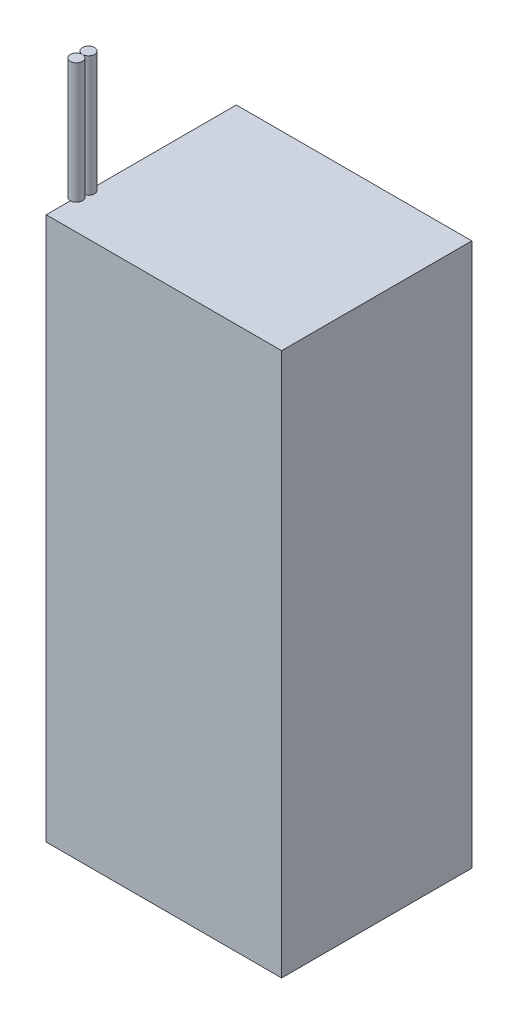
ISO-10303-21;
HEADER;
FILE_DESCRIPTION(('STEP AP214'),'2;1');
FILE_NAME('part.step','',(''),(''),'','','');
FILE_SCHEMA(('AUTOMOTIVE_DESIGN { 1 0 10303 214 1 1 1 1 }'));
ENDSEC;
DATA;
#1=APPLICATION_CONTEXT('core data for automotive mechanical design processes');
#2=APPLICATION_PROTOCOL_DEFINITION('international standard','automotive_design',2000,#1);
#3=PRODUCT_CONTEXT('',#1,'mechanical');
#4=PRODUCT('Part','Part','',(#3));
#5=PRODUCT_RELATED_PRODUCT_CATEGORY('part','',(#4));
#6=PRODUCT_DEFINITION_FORMATION('','',#4);
#7=PRODUCT_DEFINITION_CONTEXT('part definition',#1,'design');
#8=PRODUCT_DEFINITION('design','',#6,#7);
#9=PRODUCT_DEFINITION_SHAPE('','',#8);
#10=(LENGTH_UNIT() NAMED_UNIT(*) SI_UNIT(.MILLI.,.METRE.));
#11=(NAMED_UNIT(*) PLANE_ANGLE_UNIT() SI_UNIT($,.RADIAN.));
#12=(NAMED_UNIT(*) SI_UNIT($,.STERADIAN.) SOLID_ANGLE_UNIT());
#13=UNCERTAINTY_MEASURE_WITH_UNIT(LENGTH_MEASURE(1.E-05),#10,'distance_accuracy_value','');
#14=(GEOMETRIC_REPRESENTATION_CONTEXT(3) GLOBAL_UNCERTAINTY_ASSIGNED_CONTEXT((#13)) GLOBAL_UNIT_ASSIGNED_CONTEXT((#10,
#11,#12)) REPRESENTATION_CONTEXT('',''));
#15=CARTESIAN_POINT('',(0.,0.,0.));
#16=DIRECTION('',(0.,0.,1.));
#17=DIRECTION('',(1.,0.,0.));
#18=AXIS2_PLACEMENT_3D('',#15,#16,#17);
#19=CARTESIAN_POINT('',(-39.,220.,17.5));
#20=DIRECTION('',(0.,-1.,0.));
#21=DIRECTION('',(0.,0.,-1.));
#22=AXIS2_PLACEMENT_3D('',#19,#20,#21);
#23=CYLINDRICAL_SURFACE('',#22,2.);
#24=CARTESIAN_POINT('',(-39.,220.,17.5));
#25=DIRECTION('',(0.,1.,0.));
#26=DIRECTION('',(0.,0.,1.));
#27=AXIS2_PLACEMENT_3D('',#24,#25,#26);
#28=CIRCLE('',#27,2.);
#29=CARTESIAN_POINT('',(-39.,220.,19.5));
#30=VERTEX_POINT('',#29);
#31=EDGE_CURVE('E11',#30,#30,#28,.T.);
#32=ORIENTED_EDGE('',*,*,#31,.F.);
#33=EDGE_LOOP('',(#32));
#34=FACE_BOUND('',#33,.T.);
#35=CARTESIAN_POINT('',(-39.,180.,17.5));
#36=DIRECTION('',(0.,1.,0.));
#37=DIRECTION('',(0.,0.,1.));
#38=AXIS2_PLACEMENT_3D('',#35,#36,#37);
#39=CIRCLE('',#38,2.);
#40=CARTESIAN_POINT('',(-39.,180.,19.5));
#41=VERTEX_POINT('',#40);
#42=EDGE_CURVE('E51',#41,#41,#39,.T.);
#43=ORIENTED_EDGE('',*,*,#42,.T.);
#44=EDGE_LOOP('',(#43));
#45=FACE_BOUND('',#44,.T.);
#46=ADVANCED_FACE('F48',(#34,#45),#23,.T.);
#47=CARTESIAN_POINT('',(0.,220.,0.));
#48=DIRECTION('',(0.,1.,0.));
#49=DIRECTION('',(0.,0.,1.));
#50=AXIS2_PLACEMENT_3D('',#47,#48,#49);
#51=PLANE('',#50);
#52=ORIENTED_EDGE('',*,*,#31,.T.);
#53=EDGE_LOOP('',(#52));
#54=FACE_BOUND('',#53,.T.);
#55=ADVANCED_FACE('F63',(#54),#51,.T.);
#56=CARTESIAN_POINT('',(0.,180.,0.));
#57=DIRECTION('',(0.,1.,0.));
#58=DIRECTION('',(0.,0.,1.));
#59=AXIS2_PLACEMENT_3D('',#56,#57,#58);
#60=PLANE('',#59);
#61=ORIENTED_EDGE('',*,*,#42,.F.);
#62=EDGE_LOOP('',(#61));
#63=FACE_BOUND('',#62,.T.);
#64=ADVANCED_FACE('F61',(#63),#60,.F.);
#65=CLOSED_SHELL('',(#46,#55,#64));
#66=MANIFOLD_SOLID_BREP('B2',#65);
#67=CARTESIAN_POINT('',(-39.,220.,21.5));
#68=DIRECTION('',(0.,-1.,0.));
#69=DIRECTION('',(0.,0.,-1.));
#70=AXIS2_PLACEMENT_3D('',#67,#68,#69);
#71=CYLINDRICAL_SURFACE('',#70,2.);
#72=CARTESIAN_POINT('',(-39.,220.,21.5));
#73=DIRECTION('',(0.,1.,0.));
#74=DIRECTION('',(0.,0.,1.));
#75=AXIS2_PLACEMENT_3D('',#72,#73,#74);
#76=CIRCLE('',#75,2.);
#77=CARTESIAN_POINT('',(-39.,220.,23.5));
#78=VERTEX_POINT('',#77);
#79=EDGE_CURVE('E47',#78,#78,#76,.T.);
#80=ORIENTED_EDGE('',*,*,#79,.F.);
#81=EDGE_LOOP('',(#80));
#82=FACE_BOUND('',#81,.T.);
#83=CARTESIAN_POINT('',(-39.,180.,21.5));
#84=DIRECTION('',(0.,1.,0.));
#85=DIRECTION('',(0.,0.,1.));
#86=AXIS2_PLACEMENT_3D('',#83,#84,#85);
#87=CIRCLE('',#86,2.);
#88=CARTESIAN_POINT('',(-39.,180.,23.5));
#89=VERTEX_POINT('',#88);
#90=EDGE_CURVE('E109',#89,#89,#87,.T.);
#91=ORIENTED_EDGE('',*,*,#90,.T.);
#92=EDGE_LOOP('',(#91));
#93=FACE_BOUND('',#92,.T.);
#94=ADVANCED_FACE('F106',(#82,#93),#71,.T.);
#95=CARTESIAN_POINT('',(0.,220.,0.));
#96=DIRECTION('',(0.,1.,0.));
#97=DIRECTION('',(0.,0.,1.));
#98=AXIS2_PLACEMENT_3D('',#95,#96,#97);
#99=PLANE('',#98);
#100=ORIENTED_EDGE('',*,*,#79,.T.);
#101=EDGE_LOOP('',(#100));
#102=FACE_BOUND('',#101,.T.);
#103=ADVANCED_FACE('F121',(#102),#99,.T.);
#104=CARTESIAN_POINT('',(0.,180.,0.));
#105=DIRECTION('',(0.,1.,0.));
#106=DIRECTION('',(0.,0.,1.));
#107=AXIS2_PLACEMENT_3D('',#104,#105,#106);
#108=PLANE('',#107);
#109=ORIENTED_EDGE('',*,*,#90,.F.);
#110=EDGE_LOOP('',(#109));
#111=FACE_BOUND('',#110,.T.);
#112=ADVANCED_FACE('F119',(#111),#108,.F.);
#113=CLOSED_SHELL('',(#94,#103,#112));
#114=MANIFOLD_SOLID_BREP('B6',#113);
#115=CARTESIAN_POINT('',(39.,180.,31.5));
#116=DIRECTION('',(-1.,0.,0.));
#117=DIRECTION('',(0.,0.,1.));
#118=AXIS2_PLACEMENT_3D('',#115,#116,#117);
#119=PLANE('',#118);
#120=DIRECTION('',(0.,0.,-1.));
#121=VECTOR('',#120,1.);
#122=CARTESIAN_POINT('',(39.,0.,31.5));
#123=LINE('',#122,#121);
#124=CARTESIAN_POINT('',(39.,0.,31.5));
#125=VERTEX_POINT('',#124);
#126=CARTESIAN_POINT('',(39.,0.,-31.5));
#127=VERTEX_POINT('',#126);
#128=EDGE_CURVE('E218',#125,#127,#123,.T.);
#129=ORIENTED_EDGE('',*,*,#128,.T.);
#130=DIRECTION('',(0.,-1.,0.));
#131=VECTOR('',#130,1.);
#132=CARTESIAN_POINT('',(39.,180.,-31.5));
#133=LINE('',#132,#131);
#134=CARTESIAN_POINT('',(39.,180.,-31.5));
#135=VERTEX_POINT('',#134);
#136=EDGE_CURVE('E104',#135,#127,#133,.T.);
#137=ORIENTED_EDGE('',*,*,#136,.F.);
#138=DIRECTION('',(0.,0.,-1.));
#139=VECTOR('',#138,1.);
#140=CARTESIAN_POINT('',(39.,180.,31.5));
#141=LINE('',#140,#139);
#142=CARTESIAN_POINT('',(39.,180.,31.5));
#143=VERTEX_POINT('',#142);
#144=EDGE_CURVE('E206',#143,#135,#141,.T.);
#145=ORIENTED_EDGE('',*,*,#144,.F.);
#146=DIRECTION('',(0.,-1.,0.));
#147=VECTOR('',#146,1.);
#148=CARTESIAN_POINT('',(39.,180.,31.5));
#149=LINE('',#148,#147);
#150=EDGE_CURVE('E214',#143,#125,#149,.T.);
#151=ORIENTED_EDGE('',*,*,#150,.T.);
#152=EDGE_LOOP('',(#129,#137,#145,#151));
#153=FACE_BOUND('',#152,.T.);
#154=ADVANCED_FACE('F155',(#153),#119,.F.);
#155=CARTESIAN_POINT('',(-39.,180.,-31.5));
#156=DIRECTION('',(0.,0.,1.));
#157=DIRECTION('',(1.,0.,0.));
#158=AXIS2_PLACEMENT_3D('',#155,#156,#157);
#159=PLANE('',#158);
#160=DIRECTION('',(-1.,0.,0.));
#161=VECTOR('',#160,1.);
#162=CARTESIAN_POINT('',(-39.,0.,-31.5));
#163=LINE('',#162,#161);
#164=CARTESIAN_POINT('',(-39.,0.,-31.5));
#165=VERTEX_POINT('',#164);
#166=EDGE_CURVE('E210',#127,#165,#163,.T.);
#167=ORIENTED_EDGE('',*,*,#166,.T.);
#168=DIRECTION('',(0.,-1.,0.));
#169=VECTOR('',#168,1.);
#170=CARTESIAN_POINT('',(-39.,180.,-31.5));
#171=LINE('',#170,#169);
#172=CARTESIAN_POINT('',(-39.,180.,-31.5));
#173=VERTEX_POINT('',#172);
#174=EDGE_CURVE('E163',#173,#165,#171,.T.);
#175=ORIENTED_EDGE('',*,*,#174,.F.);
#176=DIRECTION('',(-1.,0.,0.));
#177=VECTOR('',#176,1.);
#178=CARTESIAN_POINT('',(-39.,180.,-31.5));
#179=LINE('',#178,#177);
#180=EDGE_CURVE('E201',#135,#173,#179,.T.);
#181=ORIENTED_EDGE('',*,*,#180,.F.);
#182=ORIENTED_EDGE('',*,*,#136,.T.);
#183=EDGE_LOOP('',(#167,#175,#181,#182));
#184=FACE_BOUND('',#183,.T.);
#185=ADVANCED_FACE('F209',(#184),#159,.F.);
#186=CARTESIAN_POINT('',(-39.,180.,31.5));
#187=DIRECTION('',(1.,0.,0.));
#188=DIRECTION('',(0.,0.,-1.));
#189=AXIS2_PLACEMENT_3D('',#186,#187,#188);
#190=PLANE('',#189);
#191=DIRECTION('',(0.,0.,1.));
#192=VECTOR('',#191,1.);
#193=CARTESIAN_POINT('',(-39.,0.,31.5));
#194=LINE('',#193,#192);
#195=CARTESIAN_POINT('',(-39.,0.,31.5));
#196=VERTEX_POINT('',#195);
#197=EDGE_CURVE('E188',#165,#196,#194,.T.);
#198=ORIENTED_EDGE('',*,*,#197,.T.);
#199=DIRECTION('',(0.,-1.,0.));
#200=VECTOR('',#199,1.);
#201=CARTESIAN_POINT('',(-39.,180.,31.5));
#202=LINE('',#201,#200);
#203=CARTESIAN_POINT('',(-39.,180.,31.5));
#204=VERTEX_POINT('',#203);
#205=EDGE_CURVE('E211',#204,#196,#202,.T.);
#206=ORIENTED_EDGE('',*,*,#205,.F.);
#207=DIRECTION('',(0.,0.,1.));
#208=VECTOR('',#207,1.);
#209=CARTESIAN_POINT('',(-39.,180.,31.5));
#210=LINE('',#209,#208);
#211=EDGE_CURVE('E204',#173,#204,#210,.T.);
#212=ORIENTED_EDGE('',*,*,#211,.F.);
#213=ORIENTED_EDGE('',*,*,#174,.T.);
#214=EDGE_LOOP('',(#198,#206,#212,#213));
#215=FACE_BOUND('',#214,.T.);
#216=ADVANCED_FACE('F212',(#215),#190,.F.);
#217=CARTESIAN_POINT('',(-39.,180.,31.5));
#218=DIRECTION('',(0.,0.,-1.));
#219=DIRECTION('',(-1.,0.,0.));
#220=AXIS2_PLACEMENT_3D('',#217,#218,#219);
#221=PLANE('',#220);
#222=DIRECTION('',(1.,0.,0.));
#223=VECTOR('',#222,1.);
#224=CARTESIAN_POINT('',(-39.,0.,31.5));
#225=LINE('',#224,#223);
#226=EDGE_CURVE('E194',#196,#125,#225,.T.);
#227=ORIENTED_EDGE('',*,*,#226,.T.);
#228=ORIENTED_EDGE('',*,*,#150,.F.);
#229=DIRECTION('',(1.,0.,0.));
#230=VECTOR('',#229,1.);
#231=CARTESIAN_POINT('',(-39.,180.,31.5));
#232=LINE('',#231,#230);
#233=EDGE_CURVE('E171',#204,#143,#232,.T.);
#234=ORIENTED_EDGE('',*,*,#233,.F.);
#235=ORIENTED_EDGE('',*,*,#205,.T.);
#236=EDGE_LOOP('',(#227,#228,#234,#235));
#237=FACE_BOUND('',#236,.T.);
#238=ADVANCED_FACE('F225',(#237),#221,.F.);
#239=CARTESIAN_POINT('',(0.,180.,0.));
#240=DIRECTION('',(0.,-1.,0.));
#241=DIRECTION('',(0.,0.,-1.));
#242=AXIS2_PLACEMENT_3D('',#239,#240,#241);
#243=PLANE('',#242);
#244=ORIENTED_EDGE('',*,*,#144,.T.);
#245=ORIENTED_EDGE('',*,*,#180,.T.);
#246=ORIENTED_EDGE('',*,*,#211,.T.);
#247=ORIENTED_EDGE('',*,*,#233,.T.);
#248=EDGE_LOOP('',(#244,#245,#246,#247));
#249=FACE_BOUND('',#248,.T.);
#250=ADVANCED_FACE('F202',(#249),#243,.F.);
#251=CARTESIAN_POINT('',(0.,0.,0.));
#252=DIRECTION('',(0.,-1.,0.));
#253=DIRECTION('',(0.,0.,-1.));
#254=AXIS2_PLACEMENT_3D('',#251,#252,#253);
#255=PLANE('',#254);
#256=ORIENTED_EDGE('',*,*,#128,.F.);
#257=ORIENTED_EDGE('',*,*,#226,.F.);
#258=ORIENTED_EDGE('',*,*,#197,.F.);
#259=ORIENTED_EDGE('',*,*,#166,.F.);
#260=EDGE_LOOP('',(#256,#257,#258,#259));
#261=FACE_BOUND('',#260,.T.);
#262=ADVANCED_FACE('F228',(#261),#255,.T.);
#263=CLOSED_SHELL('',(#154,#185,#216,#238,#250,#262));
#264=MANIFOLD_SOLID_BREP('B42',#263);
#265=ADVANCED_BREP_SHAPE_REPRESENTATION('',(#18,#66,#114,#264),#14);
#266=SHAPE_DEFINITION_REPRESENTATION(#9,#265);
ENDSEC;
END-ISO-10303-21;
